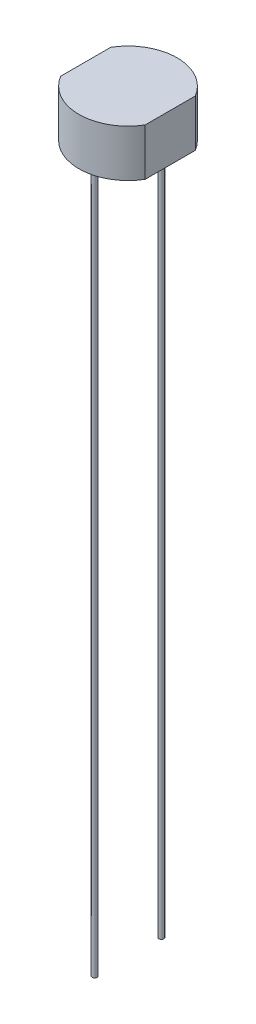
ISO-10303-21;
HEADER;
FILE_DESCRIPTION(('STEP AP214'),'2;1');
FILE_NAME('part.step','',(''),(''),'','','');
FILE_SCHEMA(('AUTOMOTIVE_DESIGN { 1 0 10303 214 1 1 1 1 }'));
ENDSEC;
DATA;
#1=APPLICATION_CONTEXT('core data for automotive mechanical design processes');
#2=APPLICATION_PROTOCOL_DEFINITION('international standard','automotive_design',2000,#1);
#3=PRODUCT_CONTEXT('',#1,'mechanical');
#4=PRODUCT('Part','Part','',(#3));
#5=PRODUCT_RELATED_PRODUCT_CATEGORY('part','',(#4));
#6=PRODUCT_DEFINITION_FORMATION('','',#4);
#7=PRODUCT_DEFINITION_CONTEXT('part definition',#1,'design');
#8=PRODUCT_DEFINITION('design','',#6,#7);
#9=PRODUCT_DEFINITION_SHAPE('','',#8);
#10=(LENGTH_UNIT() NAMED_UNIT(*) SI_UNIT(.MILLI.,.METRE.));
#11=(NAMED_UNIT(*) PLANE_ANGLE_UNIT() SI_UNIT($,.RADIAN.));
#12=(NAMED_UNIT(*) SI_UNIT($,.STERADIAN.) SOLID_ANGLE_UNIT());
#13=UNCERTAINTY_MEASURE_WITH_UNIT(LENGTH_MEASURE(1.E-05),#10,'distance_accuracy_value','');
#14=(GEOMETRIC_REPRESENTATION_CONTEXT(3) GLOBAL_UNCERTAINTY_ASSIGNED_CONTEXT((#13)) GLOBAL_UNIT_ASSIGNED_CONTEXT((#10,
#11,#12)) REPRESENTATION_CONTEXT('',''));
#15=CARTESIAN_POINT('',(0.,0.,0.));
#16=DIRECTION('',(0.,0.,1.));
#17=DIRECTION('',(1.,0.,0.));
#18=AXIS2_PLACEMENT_3D('',#15,#16,#17);
#19=CARTESIAN_POINT('',(-2.15,2.4,-1.27573508221731));
#20=DIRECTION('',(1.,0.,0.));
#21=DIRECTION('',(0.,0.,-1.));
#22=AXIS2_PLACEMENT_3D('',#19,#20,#21);
#23=PLANE('',#22);
#24=DIRECTION('',(0.,0.,1.));
#25=VECTOR('',#24,1.);
#26=CARTESIAN_POINT('',(-2.15,0.,-1.27573508221731));
#27=LINE('',#26,#25);
#28=CARTESIAN_POINT('',(-2.15,0.,-1.27573508221731));
#29=VERTEX_POINT('',#28);
#30=CARTESIAN_POINT('',(-2.15,0.,1.27573508221731));
#31=VERTEX_POINT('',#30);
#32=EDGE_CURVE('E110',#29,#31,#27,.T.);
#33=ORIENTED_EDGE('',*,*,#32,.T.);
#34=DIRECTION('',(0.,-1.,0.));
#35=VECTOR('',#34,1.);
#36=CARTESIAN_POINT('',(-2.15,2.4,1.27573508221731));
#37=LINE('',#36,#35);
#38=CARTESIAN_POINT('',(-2.15,2.4,1.27573508221731));
#39=VERTEX_POINT('',#38);
#40=EDGE_CURVE('E11',#39,#31,#37,.T.);
#41=ORIENTED_EDGE('',*,*,#40,.F.);
#42=DIRECTION('',(0.,0.,1.));
#43=VECTOR('',#42,1.);
#44=CARTESIAN_POINT('',(-2.15,2.4,-1.27573508221731));
#45=LINE('',#44,#43);
#46=CARTESIAN_POINT('',(-2.15,2.4,-1.27573508221731));
#47=VERTEX_POINT('',#46);
#48=EDGE_CURVE('E92',#47,#39,#45,.T.);
#49=ORIENTED_EDGE('',*,*,#48,.F.);
#50=DIRECTION('',(0.,-1.,0.));
#51=VECTOR('',#50,1.);
#52=CARTESIAN_POINT('',(-2.15,2.4,-1.27573508221731));
#53=LINE('',#52,#51);
#54=EDGE_CURVE('E59',#47,#29,#53,.T.);
#55=ORIENTED_EDGE('',*,*,#54,.T.);
#56=EDGE_LOOP('',(#33,#41,#49,#55));
#57=FACE_BOUND('',#56,.T.);
#58=ADVANCED_FACE('F42',(#57),#23,.F.);
#59=CARTESIAN_POINT('',(0.,2.4,0.));
#60=DIRECTION('',(0.,-1.,0.));
#61=DIRECTION('',(0.,0.,-1.));
#62=AXIS2_PLACEMENT_3D('',#59,#60,#61);
#63=CYLINDRICAL_SURFACE('',#62,2.5);
#64=CARTESIAN_POINT('',(0.,0.,0.));
#65=DIRECTION('',(0.,1.,0.));
#66=DIRECTION('',(0.,0.,1.));
#67=AXIS2_PLACEMENT_3D('',#64,#65,#66);
#68=CIRCLE('',#67,2.5);
#69=CARTESIAN_POINT('',(2.15,0.,1.27573508221731));
#70=VERTEX_POINT('',#69);
#71=EDGE_CURVE('E98',#31,#70,#68,.T.);
#72=ORIENTED_EDGE('',*,*,#71,.T.);
#73=DIRECTION('',(0.,-1.,0.));
#74=VECTOR('',#73,1.);
#75=CARTESIAN_POINT('',(2.15,2.4,1.27573508221731));
#76=LINE('',#75,#74);
#77=CARTESIAN_POINT('',(2.15,2.4,1.27573508221731));
#78=VERTEX_POINT('',#77);
#79=EDGE_CURVE('E51',#78,#70,#76,.T.);
#80=ORIENTED_EDGE('',*,*,#79,.F.);
#81=CARTESIAN_POINT('',(0.,2.4,0.));
#82=DIRECTION('',(0.,1.,0.));
#83=DIRECTION('',(0.,0.,1.));
#84=AXIS2_PLACEMENT_3D('',#81,#82,#83);
#85=CIRCLE('',#84,2.5);
#86=EDGE_CURVE('E84',#39,#78,#85,.T.);
#87=ORIENTED_EDGE('',*,*,#86,.F.);
#88=ORIENTED_EDGE('',*,*,#40,.T.);
#89=EDGE_LOOP('',(#72,#80,#87,#88));
#90=FACE_BOUND('',#89,.T.);
#91=ADVANCED_FACE('F97',(#90),#63,.T.);
#92=CARTESIAN_POINT('',(2.15,2.4,-1.27573508221731));
#93=DIRECTION('',(1.,0.,0.));
#94=DIRECTION('',(0.,0.,-1.));
#95=AXIS2_PLACEMENT_3D('',#92,#93,#94);
#96=PLANE('',#95);
#97=DIRECTION('',(0.,0.,1.));
#98=VECTOR('',#97,1.);
#99=CARTESIAN_POINT('',(2.15,0.,-1.27573508221731));
#100=LINE('',#99,#98);
#101=CARTESIAN_POINT('',(2.15,0.,-1.27573508221731));
#102=VERTEX_POINT('',#101);
#103=EDGE_CURVE('E116',#102,#70,#100,.T.);
#104=ORIENTED_EDGE('',*,*,#103,.F.);
#105=DIRECTION('',(0.,-1.,0.));
#106=VECTOR('',#105,1.);
#107=CARTESIAN_POINT('',(2.15,2.4,-1.27573508221731));
#108=LINE('',#107,#106);
#109=CARTESIAN_POINT('',(2.15,2.4,-1.27573508221731));
#110=VERTEX_POINT('',#109);
#111=EDGE_CURVE('E73',#110,#102,#108,.T.);
#112=ORIENTED_EDGE('',*,*,#111,.F.);
#113=DIRECTION('',(0.,0.,1.));
#114=VECTOR('',#113,1.);
#115=CARTESIAN_POINT('',(2.15,2.4,-1.27573508221731));
#116=LINE('',#115,#114);
#117=EDGE_CURVE('E91',#110,#78,#116,.T.);
#118=ORIENTED_EDGE('',*,*,#117,.T.);
#119=ORIENTED_EDGE('',*,*,#79,.T.);
#120=EDGE_LOOP('',(#104,#112,#118,#119));
#121=FACE_BOUND('',#120,.T.);
#122=ADVANCED_FACE('F102',(#121),#96,.T.);
#123=CARTESIAN_POINT('',(0.,2.4,0.));
#124=DIRECTION('',(0.,-1.,0.));
#125=DIRECTION('',(0.,0.,-1.));
#126=AXIS2_PLACEMENT_3D('',#123,#124,#125);
#127=CYLINDRICAL_SURFACE('',#126,2.5);
#128=CARTESIAN_POINT('',(0.,0.,0.));
#129=DIRECTION('',(0.,-1.,0.));
#130=DIRECTION('',(0.,0.,-1.));
#131=AXIS2_PLACEMENT_3D('',#128,#129,#130);
#132=CIRCLE('',#131,2.5);
#133=EDGE_CURVE('E119',#29,#102,#132,.T.);
#134=ORIENTED_EDGE('',*,*,#133,.F.);
#135=ORIENTED_EDGE('',*,*,#54,.F.);
#136=CARTESIAN_POINT('',(0.,2.4,0.));
#137=DIRECTION('',(0.,-1.,0.));
#138=DIRECTION('',(0.,0.,-1.));
#139=AXIS2_PLACEMENT_3D('',#136,#137,#138);
#140=CIRCLE('',#139,2.5);
#141=EDGE_CURVE('E104',#47,#110,#140,.T.);
#142=ORIENTED_EDGE('',*,*,#141,.T.);
#143=ORIENTED_EDGE('',*,*,#111,.T.);
#144=EDGE_LOOP('',(#134,#135,#142,#143));
#145=FACE_BOUND('',#144,.T.);
#146=ADVANCED_FACE('F167',(#145),#127,.T.);
#147=CARTESIAN_POINT('',(0.,2.4,0.));
#148=DIRECTION('',(0.,1.,0.));
#149=DIRECTION('',(0.,0.,1.));
#150=AXIS2_PLACEMENT_3D('',#147,#148,#149);
#151=PLANE('',#150);
#152=ORIENTED_EDGE('',*,*,#48,.T.);
#153=ORIENTED_EDGE('',*,*,#86,.T.);
#154=ORIENTED_EDGE('',*,*,#117,.F.);
#155=ORIENTED_EDGE('',*,*,#141,.F.);
#156=EDGE_LOOP('',(#152,#153,#154,#155));
#157=FACE_BOUND('',#156,.T.);
#158=ADVANCED_FACE('F88',(#157),#151,.T.);
#159=CARTESIAN_POINT('',(0.,0.,0.));
#160=DIRECTION('',(0.,1.,0.));
#161=DIRECTION('',(0.,0.,1.));
#162=AXIS2_PLACEMENT_3D('',#159,#160,#161);
#163=PLANE('',#162);
#164=CARTESIAN_POINT('',(0.,0.,1.7));
#165=DIRECTION('',(0.,1.,0.));
#166=DIRECTION('',(0.,0.,-1.));
#167=AXIS2_PLACEMENT_3D('',#164,#165,#166);
#168=CIRCLE('',#167,0.125);
#169=CARTESIAN_POINT('',(0.,0.,1.575));
#170=VERTEX_POINT('',#169);
#171=EDGE_CURVE('E133',#170,#170,#168,.T.);
#172=ORIENTED_EDGE('',*,*,#171,.T.);
#173=EDGE_LOOP('',(#172));
#174=FACE_BOUND('',#173,.T.);
#175=CARTESIAN_POINT('',(0.,0.,-1.7));
#176=DIRECTION('',(0.,1.,0.));
#177=DIRECTION('',(0.,0.,1.));
#178=AXIS2_PLACEMENT_3D('',#175,#176,#177);
#179=CIRCLE('',#178,0.125);
#180=CARTESIAN_POINT('',(0.,0.,-1.575));
#181=VERTEX_POINT('',#180);
#182=EDGE_CURVE('E129',#181,#181,#179,.T.);
#183=ORIENTED_EDGE('',*,*,#182,.T.);
#184=EDGE_LOOP('',(#183));
#185=FACE_BOUND('',#184,.T.);
#186=ORIENTED_EDGE('',*,*,#32,.F.);
#187=ORIENTED_EDGE('',*,*,#133,.T.);
#188=ORIENTED_EDGE('',*,*,#103,.T.);
#189=ORIENTED_EDGE('',*,*,#71,.F.);
#190=EDGE_LOOP('',(#186,#187,#188,#189));
#191=FACE_BOUND('',#190,.T.);
#192=ADVANCED_FACE('F145',(#174,#185,#191),#163,.F.);
#193=CARTESIAN_POINT('',(0.,-36.,-1.7));
#194=DIRECTION('',(0.,1.,0.));
#195=DIRECTION('',(0.,0.,1.));
#196=AXIS2_PLACEMENT_3D('',#193,#194,#195);
#197=CYLINDRICAL_SURFACE('',#196,0.125);
#198=CARTESIAN_POINT('',(0.,-36.,-1.7));
#199=DIRECTION('',(0.,1.,0.));
#200=DIRECTION('',(0.,0.,1.));
#201=AXIS2_PLACEMENT_3D('',#198,#199,#200);
#202=CIRCLE('',#201,0.125);
#203=CARTESIAN_POINT('',(0.,-36.,-1.575));
#204=VERTEX_POINT('',#203);
#205=EDGE_CURVE('E113',#204,#204,#202,.T.);
#206=ORIENTED_EDGE('',*,*,#205,.T.);
#207=EDGE_LOOP('',(#206));
#208=FACE_BOUND('',#207,.T.);
#209=ORIENTED_EDGE('',*,*,#182,.F.);
#210=EDGE_LOOP('',(#209));
#211=FACE_BOUND('',#210,.T.);
#212=ADVANCED_FACE('F160',(#208,#211),#197,.T.);
#213=CARTESIAN_POINT('',(0.,-36.,-1.7));
#214=DIRECTION('',(0.,1.,0.));
#215=DIRECTION('',(0.,0.,1.));
#216=AXIS2_PLACEMENT_3D('',#213,#214,#215);
#217=PLANE('',#216);
#218=ORIENTED_EDGE('',*,*,#205,.F.);
#219=EDGE_LOOP('',(#218));
#220=FACE_BOUND('',#219,.T.);
#221=ADVANCED_FACE('F151',(#220),#217,.F.);
#222=CARTESIAN_POINT('',(0.,-36.,1.7));
#223=DIRECTION('',(0.,1.,0.));
#224=DIRECTION('',(0.,0.,1.));
#225=AXIS2_PLACEMENT_3D('',#222,#223,#224);
#226=CYLINDRICAL_SURFACE('',#225,0.125);
#227=CARTESIAN_POINT('',(0.,-36.,1.7));
#228=DIRECTION('',(0.,1.,0.));
#229=DIRECTION('',(0.,0.,-1.));
#230=AXIS2_PLACEMENT_3D('',#227,#228,#229);
#231=CIRCLE('',#230,0.125);
#232=CARTESIAN_POINT('',(0.,-36.,1.575));
#233=VERTEX_POINT('',#232);
#234=EDGE_CURVE('E137',#233,#233,#231,.T.);
#235=ORIENTED_EDGE('',*,*,#234,.T.);
#236=EDGE_LOOP('',(#235));
#237=FACE_BOUND('',#236,.T.);
#238=ORIENTED_EDGE('',*,*,#171,.F.);
#239=EDGE_LOOP('',(#238));
#240=FACE_BOUND('',#239,.T.);
#241=ADVANCED_FACE('F148',(#237,#240),#226,.T.);
#242=CARTESIAN_POINT('',(0.,-36.,1.7));
#243=DIRECTION('',(0.,-1.,0.));
#244=DIRECTION('',(0.,0.,-1.));
#245=AXIS2_PLACEMENT_3D('',#242,#243,#244);
#246=PLANE('',#245);
#247=ORIENTED_EDGE('',*,*,#234,.F.);
#248=EDGE_LOOP('',(#247));
#249=FACE_BOUND('',#248,.T.);
#250=ADVANCED_FACE('F150',(#249),#246,.T.);
#251=CLOSED_SHELL('',(#58,#91,#122,#146,#158,#192,#212,#221,#241,#250));
#252=MANIFOLD_SOLID_BREP('B2',#251);
#253=ADVANCED_BREP_SHAPE_REPRESENTATION('',(#18,#252),#14);
#254=SHAPE_DEFINITION_REPRESENTATION(#9,#253);
ENDSEC;
END-ISO-10303-21;
